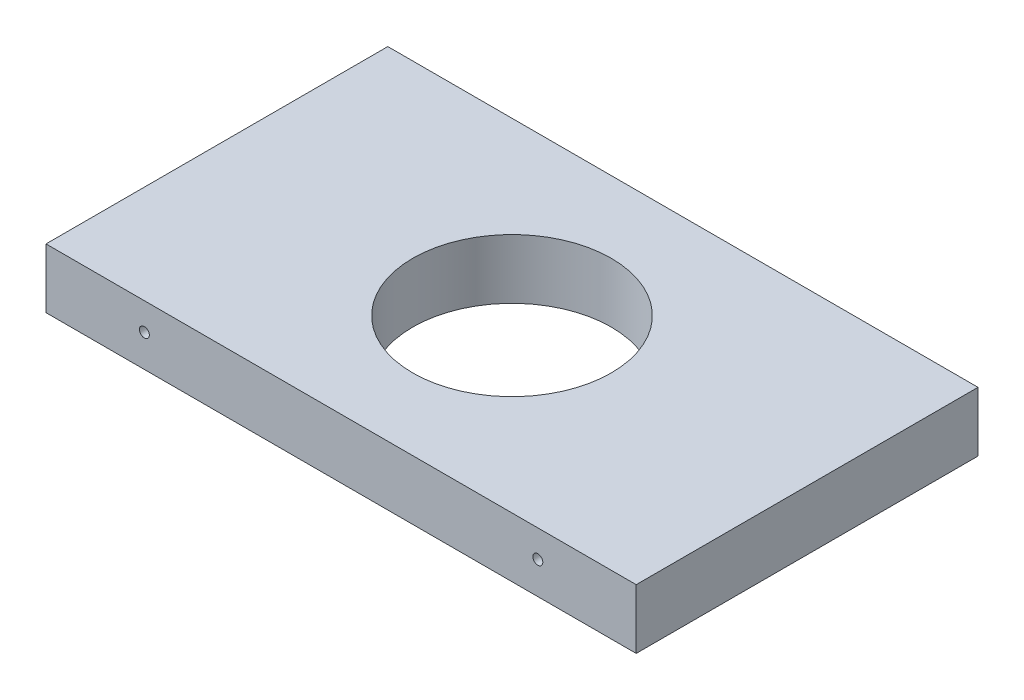
ISO-10303-21;
HEADER;
FILE_DESCRIPTION(('STEP AP214'),'2;1');
FILE_NAME('part.step','',(''),(''),'','','');
FILE_SCHEMA(('AUTOMOTIVE_DESIGN { 1 0 10303 214 1 1 1 1 }'));
ENDSEC;
DATA;
#1=APPLICATION_CONTEXT('core data for automotive mechanical design processes');
#2=APPLICATION_PROTOCOL_DEFINITION('international standard','automotive_design',2000,#1);
#3=PRODUCT_CONTEXT('',#1,'mechanical');
#4=PRODUCT('Part','Part','',(#3));
#5=PRODUCT_RELATED_PRODUCT_CATEGORY('part','',(#4));
#6=PRODUCT_DEFINITION_FORMATION('','',#4);
#7=PRODUCT_DEFINITION_CONTEXT('part definition',#1,'design');
#8=PRODUCT_DEFINITION('design','',#6,#7);
#9=PRODUCT_DEFINITION_SHAPE('','',#8);
#10=(LENGTH_UNIT() NAMED_UNIT(*) SI_UNIT(.MILLI.,.METRE.));
#11=(NAMED_UNIT(*) PLANE_ANGLE_UNIT() SI_UNIT($,.RADIAN.));
#12=(NAMED_UNIT(*) SI_UNIT($,.STERADIAN.) SOLID_ANGLE_UNIT());
#13=UNCERTAINTY_MEASURE_WITH_UNIT(LENGTH_MEASURE(1.E-05),#10,'distance_accuracy_value','');
#14=(GEOMETRIC_REPRESENTATION_CONTEXT(3) GLOBAL_UNCERTAINTY_ASSIGNED_CONTEXT((#13)) GLOBAL_UNIT_ASSIGNED_CONTEXT((#10,
#11,#12)) REPRESENTATION_CONTEXT('',''));
#15=CARTESIAN_POINT('',(0.,0.,0.));
#16=DIRECTION('',(0.,0.,1.));
#17=DIRECTION('',(1.,0.,0.));
#18=AXIS2_PLACEMENT_3D('',#15,#16,#17);
#19=CARTESIAN_POINT('',(-322.254465963192,-301.846060846021,298.984021790825));
#20=DIRECTION('',(1.,0.,0.));
#21=DIRECTION('',(0.,0.,-1.00000000000003));
#22=AXIS2_PLACEMENT_3D('',#19,#20,#21);
#23=PLANE('',#22);
#24=DIRECTION('',(0.,-1.00000000000005,0.));
#25=VECTOR('',#24,1.);
#26=CARTESIAN_POINT('',(-322.254465963194,-301.846060846017,109.300000000013));
#27=LINE('',#26,#25);
#28=CARTESIAN_POINT('',(-322.254465963193,-282.796060846016,109.300000000013));
#29=VERTEX_POINT('',#28);
#30=CARTESIAN_POINT('',(-322.254465963193,-301.846060846017,109.300000000013));
#31=VERTEX_POINT('',#30);
#32=EDGE_CURVE('E141',#29,#31,#27,.T.);
#33=ORIENTED_EDGE('',*,*,#32,.F.);
#34=DIRECTION('',(0.,0.,-1.00000000000003));
#35=VECTOR('',#34,1.);
#36=CARTESIAN_POINT('',(-322.254465963191,-282.79606084602,298.984021790825));
#37=LINE('',#36,#35);
#38=CARTESIAN_POINT('',(-322.254465963193,-282.796060846013,7.21644966006352E-12));
#39=VERTEX_POINT('',#38);
#40=EDGE_CURVE('E57',#29,#39,#37,.T.);
#41=ORIENTED_EDGE('',*,*,#40,.T.);
#42=DIRECTION('',(0.,-1.00000000000005,0.));
#43=VECTOR('',#42,1.);
#44=CARTESIAN_POINT('',(-322.254465963193,-301.846060846014,8.43769498715119E-12));
#45=LINE('',#44,#43);
#46=CARTESIAN_POINT('',(-322.254465963193,-301.846060846014,8.43769498715119E-12));
#47=VERTEX_POINT('',#46);
#48=EDGE_CURVE('E137',#39,#47,#45,.T.);
#49=ORIENTED_EDGE('',*,*,#48,.T.);
#50=DIRECTION('',(0.,0.,-1.00000000000003));
#51=VECTOR('',#50,1.);
#52=CARTESIAN_POINT('',(-322.254465963192,-301.846060846021,298.984021790825));
#53=LINE('',#52,#51);
#54=EDGE_CURVE('E80',#31,#47,#53,.T.);
#55=ORIENTED_EDGE('',*,*,#54,.F.);
#56=EDGE_LOOP('',(#33,#41,#49,#55));
#57=FACE_BOUND('',#56,.T.);
#58=ADVANCED_FACE('F40',(#57),#23,.F.);
#59=CARTESIAN_POINT('',(-322.254465963192,-301.846060846021,298.984021790825));
#60=DIRECTION('',(0.,1.00000000000005,0.));
#61=DIRECTION('',(0.,0.,1.00000000000003));
#62=AXIS2_PLACEMENT_3D('',#59,#60,#61);
#63=PLANE('',#62);
#64=CARTESIAN_POINT('',(-227.891965966195,-301.846060846016,54.6500000000101));
#65=DIRECTION('',(0.,1.00000000000005,0.));
#66=DIRECTION('',(0.,0.,1.00000000000003));
#67=AXIS2_PLACEMENT_3D('',#64,#65,#66);
#68=CIRCLE('',#67,31.75);
#69=CARTESIAN_POINT('',(-227.891965966195,-301.846060846016,86.4000000000111));
#70=VERTEX_POINT('',#69);
#71=EDGE_CURVE('E109',#70,#70,#68,.T.);
#72=ORIENTED_EDGE('',*,*,#71,.T.);
#73=EDGE_LOOP('',(#72));
#74=FACE_BOUND('',#73,.T.);
#75=DIRECTION('',(1.,0.,0.));
#76=VECTOR('',#75,1.);
#77=CARTESIAN_POINT('',(-322.254465963193,-301.846060846017,109.300000000014));
#78=LINE('',#77,#76);
#79=CARTESIAN_POINT('',(-133.529465969192,-301.846060846017,109.300000000012));
#80=VERTEX_POINT('',#79);
#81=EDGE_CURVE('E49',#31,#80,#78,.T.);
#82=ORIENTED_EDGE('',*,*,#81,.F.);
#83=ORIENTED_EDGE('',*,*,#54,.T.);
#84=DIRECTION('',(1.,0.,0.));
#85=VECTOR('',#84,1.);
#86=CARTESIAN_POINT('',(-322.254465963193,-301.846060846014,8.43769498715119E-12));
#87=LINE('',#86,#85);
#88=CARTESIAN_POINT('',(-133.529465969193,-301.846060846013,7.105427357601E-12));
#89=VERTEX_POINT('',#88);
#90=EDGE_CURVE('E135',#47,#89,#87,.T.);
#91=ORIENTED_EDGE('',*,*,#90,.T.);
#92=DIRECTION('',(0.,0.,-1.00000000000003));
#93=VECTOR('',#92,1.);
#94=CARTESIAN_POINT('',(-133.529465969192,-301.846060846021,298.984021790824));
#95=LINE('',#94,#93);
#96=EDGE_CURVE('E134',#80,#89,#95,.T.);
#97=ORIENTED_EDGE('',*,*,#96,.F.);
#98=EDGE_LOOP('',(#82,#83,#91,#97));
#99=FACE_BOUND('',#98,.T.);
#100=ADVANCED_FACE('F174',(#74,#99),#63,.F.);
#101=CARTESIAN_POINT('',(-133.529465969192,-301.846060846021,298.984021790824));
#102=DIRECTION('',(-1.,0.,0.));
#103=DIRECTION('',(0.,0.,1.00000000000003));
#104=AXIS2_PLACEMENT_3D('',#101,#102,#103);
#105=PLANE('',#104);
#106=DIRECTION('',(0.,1.00000000000005,0.));
#107=VECTOR('',#106,1.);
#108=CARTESIAN_POINT('',(-133.529465969192,-301.846060846017,109.300000000011));
#109=LINE('',#108,#107);
#110=CARTESIAN_POINT('',(-133.529465969192,-282.796060846015,109.300000000011));
#111=VERTEX_POINT('',#110);
#112=EDGE_CURVE('E11',#80,#111,#109,.T.);
#113=ORIENTED_EDGE('',*,*,#112,.F.);
#114=ORIENTED_EDGE('',*,*,#96,.T.);
#115=DIRECTION('',(0.,1.00000000000005,0.));
#116=VECTOR('',#115,1.);
#117=CARTESIAN_POINT('',(-133.529465969193,-301.846060846013,7.105427357601E-12));
#118=LINE('',#117,#116);
#119=CARTESIAN_POINT('',(-133.529465969193,-282.796060846011,6.43929354282591E-12));
#120=VERTEX_POINT('',#119);
#121=EDGE_CURVE('E132',#89,#120,#118,.T.);
#122=ORIENTED_EDGE('',*,*,#121,.T.);
#123=DIRECTION('',(0.,0.,-1.00000000000003));
#124=VECTOR('',#123,1.);
#125=CARTESIAN_POINT('',(-133.529465969192,-282.796060846019,298.984021790825));
#126=LINE('',#125,#124);
#127=EDGE_CURVE('E63',#111,#120,#126,.T.);
#128=ORIENTED_EDGE('',*,*,#127,.F.);
#129=EDGE_LOOP('',(#113,#114,#122,#128));
#130=FACE_BOUND('',#129,.T.);
#131=ADVANCED_FACE('F165',(#130),#105,.F.);
#132=CARTESIAN_POINT('',(-322.254465963191,-282.79606084602,298.984021790825));
#133=DIRECTION('',(0.,-1.00000000000005,0.));
#134=DIRECTION('',(0.,0.,-1.00000000000003));
#135=AXIS2_PLACEMENT_3D('',#132,#133,#134);
#136=PLANE('',#135);
#137=CARTESIAN_POINT('',(-227.891965966193,-282.796060846014,54.6500000000094));
#138=DIRECTION('',(0.,1.00000000000005,0.));
#139=DIRECTION('',(0.,0.,1.00000000000003));
#140=AXIS2_PLACEMENT_3D('',#137,#138,#139);
#141=CIRCLE('',#140,31.75);
#142=CARTESIAN_POINT('',(-227.891965966193,-282.796060846015,86.4000000000104));
#143=VERTEX_POINT('',#142);
#144=EDGE_CURVE('E114',#143,#143,#141,.T.);
#145=ORIENTED_EDGE('',*,*,#144,.F.);
#146=EDGE_LOOP('',(#145));
#147=FACE_BOUND('',#146,.T.);
#148=DIRECTION('',(-1.,0.,0.));
#149=VECTOR('',#148,1.);
#150=CARTESIAN_POINT('',(-322.254465963193,-282.796060846016,109.300000000012));
#151=LINE('',#150,#149);
#152=EDGE_CURVE('E131',#111,#29,#151,.T.);
#153=ORIENTED_EDGE('',*,*,#152,.F.);
#154=ORIENTED_EDGE('',*,*,#127,.T.);
#155=DIRECTION('',(-1.,0.,0.));
#156=VECTOR('',#155,1.);
#157=CARTESIAN_POINT('',(-322.254465963193,-282.796060846013,7.21644966006352E-12));
#158=LINE('',#157,#156);
#159=EDGE_CURVE('E129',#120,#39,#158,.T.);
#160=ORIENTED_EDGE('',*,*,#159,.T.);
#161=ORIENTED_EDGE('',*,*,#40,.F.);
#162=EDGE_LOOP('',(#153,#154,#160,#161));
#163=FACE_BOUND('',#162,.T.);
#164=ADVANCED_FACE('F163',(#147,#163),#136,.F.);
#165=CARTESIAN_POINT('',(0.,0.,0.));
#166=DIRECTION('',(0.,0.,-1.00000000000003));
#167=DIRECTION('',(-1.,0.,0.));
#168=AXIS2_PLACEMENT_3D('',#165,#166,#167);
#169=PLANE('',#168);
#170=CARTESIAN_POINT('',(-290.800299297527,-291.54606084602,6.99440505513849E-12));
#171=DIRECTION('',(0.,0.,-1.00000000000003));
#172=DIRECTION('',(-1.,0.,0.));
#173=AXIS2_PLACEMENT_3D('',#170,#171,#172);
#174=CIRCLE('',#173,1.58750000000002);
#175=CARTESIAN_POINT('',(-292.387799297527,-291.54606084602,6.99466942699622E-12));
#176=VERTEX_POINT('',#175);
#177=EDGE_CURVE('E124',#176,#176,#174,.T.);
#178=ORIENTED_EDGE('',*,*,#177,.F.);
#179=EDGE_LOOP('',(#178));
#180=FACE_BOUND('',#179,.T.);
#181=CARTESIAN_POINT('',(-164.983632634859,-291.54606084602,6.60582699651968E-12));
#182=DIRECTION('',(0.,0.,-1.00000000000003));
#183=DIRECTION('',(-1.,0.,0.));
#184=AXIS2_PLACEMENT_3D('',#181,#182,#183);
#185=CIRCLE('',#184,1.58749999999999);
#186=CARTESIAN_POINT('',(-166.571132634859,-291.54606084602,6.60609136837742E-12));
#187=VERTEX_POINT('',#186);
#188=EDGE_CURVE('E128',#187,#187,#185,.T.);
#189=ORIENTED_EDGE('',*,*,#188,.F.);
#190=EDGE_LOOP('',(#189));
#191=FACE_BOUND('',#190,.T.);
#192=ORIENTED_EDGE('',*,*,#48,.F.);
#193=ORIENTED_EDGE('',*,*,#159,.F.);
#194=ORIENTED_EDGE('',*,*,#121,.F.);
#195=ORIENTED_EDGE('',*,*,#90,.F.);
#196=EDGE_LOOP('',(#192,#193,#194,#195));
#197=FACE_BOUND('',#196,.T.);
#198=ADVANCED_FACE('F161',(#180,#191,#197),#169,.T.);
#199=CARTESIAN_POINT('',(3.88578058618805E-13,-204.862851166391,109.300000000009));
#200=DIRECTION('',(0.,0.,1.00000000000003));
#201=DIRECTION('',(-1.,0.,0.));
#202=AXIS2_PLACEMENT_3D('',#199,#200,#201);
#203=PLANE('',#202);
#204=CARTESIAN_POINT('',(-164.983632634859,-291.546060846022,109.300000000012));
#205=DIRECTION('',(0.,0.,1.00000000000003));
#206=DIRECTION('',(1.,0.,0.));
#207=AXIS2_PLACEMENT_3D('',#204,#205,#206);
#208=CIRCLE('',#207,1.58749999999999);
#209=CARTESIAN_POINT('',(-163.396132634859,-291.546060846022,109.300000000012));
#210=VERTEX_POINT('',#209);
#211=EDGE_CURVE('E44',#210,#210,#208,.T.);
#212=ORIENTED_EDGE('',*,*,#211,.F.);
#213=EDGE_LOOP('',(#212));
#214=FACE_BOUND('',#213,.T.);
#215=CARTESIAN_POINT('',(-290.800299297527,-291.546060846023,109.300000000013));
#216=DIRECTION('',(0.,0.,1.00000000000003));
#217=DIRECTION('',(1.,0.,0.));
#218=AXIS2_PLACEMENT_3D('',#215,#216,#217);
#219=CIRCLE('',#218,1.58750000000002);
#220=CARTESIAN_POINT('',(-289.212799297527,-291.546060846023,109.300000000013));
#221=VERTEX_POINT('',#220);
#222=EDGE_CURVE('E120',#221,#221,#219,.T.);
#223=ORIENTED_EDGE('',*,*,#222,.F.);
#224=EDGE_LOOP('',(#223));
#225=FACE_BOUND('',#224,.T.);
#226=ORIENTED_EDGE('',*,*,#152,.T.);
#227=ORIENTED_EDGE('',*,*,#32,.T.);
#228=ORIENTED_EDGE('',*,*,#81,.T.);
#229=ORIENTED_EDGE('',*,*,#112,.T.);
#230=EDGE_LOOP('',(#226,#227,#228,#229));
#231=FACE_BOUND('',#230,.T.);
#232=ADVANCED_FACE('F42',(#214,#225,#231),#203,.T.);
#233=CARTESIAN_POINT('',(-164.98363263486,-291.546060846019,19.0500000000081));
#234=DIRECTION('',(0.,0.,-1.00000000000003));
#235=DIRECTION('',(0.,1.00000000000005,0.));
#236=AXIS2_PLACEMENT_3D('',#233,#234,#235);
#237=CONICAL_SURFACE('',#236,1.58749999999999,1.02974425867665);
#238=CARTESIAN_POINT('',(-164.98363263486,-291.546060846021,20.0038662327143));
#239=VERTEX_POINT('',#238);
#240=VERTEX_LOOP('',#239);
#241=FACE_BOUND('',#240,.T.);
#242=CARTESIAN_POINT('',(-164.98363263486,-291.546060846019,19.0500000000081));
#243=DIRECTION('',(0.,0.,-1.00000000000003));
#244=DIRECTION('',(0.,1.00000000000005,0.));
#245=AXIS2_PLACEMENT_3D('',#242,#243,#244);
#246=CIRCLE('',#245,1.58749999999999);
#247=CARTESIAN_POINT('',(-164.98363263486,-289.958560846019,19.0500000000081));
#248=VERTEX_POINT('',#247);
#249=EDGE_CURVE('E125',#248,#248,#246,.T.);
#250=ORIENTED_EDGE('',*,*,#249,.T.);
#251=EDGE_LOOP('',(#250));
#252=FACE_BOUND('',#251,.T.);
#253=ADVANCED_FACE('F160',(#241,#252),#237,.F.);
#254=CARTESIAN_POINT('',(-164.98363263486,-291.54606084602,-12.6999999999938));
#255=DIRECTION('',(0.,0.,-1.00000000000003));
#256=DIRECTION('',(0.,1.00000000000005,0.));
#257=AXIS2_PLACEMENT_3D('',#254,#255,#256);
#258=CYLINDRICAL_SURFACE('',#257,1.58749999999999);
#259=ORIENTED_EDGE('',*,*,#188,.T.);
#260=EDGE_LOOP('',(#259));
#261=FACE_BOUND('',#260,.T.);
#262=ORIENTED_EDGE('',*,*,#249,.F.);
#263=EDGE_LOOP('',(#262));
#264=FACE_BOUND('',#263,.T.);
#265=ADVANCED_FACE('F217',(#261,#264),#258,.F.);
#266=CARTESIAN_POINT('',(-290.800299297527,-291.54606084602,19.0500000000083));
#267=DIRECTION('',(0.,0.,-1.00000000000003));
#268=DIRECTION('',(0.,1.00000000000005,0.));
#269=AXIS2_PLACEMENT_3D('',#266,#267,#268);
#270=CONICAL_SURFACE('',#269,1.58750000000002,1.02974425867666);
#271=CARTESIAN_POINT('',(-290.800299297527,-291.546060846021,20.0038662327148));
#272=VERTEX_POINT('',#271);
#273=VERTEX_LOOP('',#272);
#274=FACE_BOUND('',#273,.T.);
#275=CARTESIAN_POINT('',(-290.800299297527,-291.54606084602,19.0500000000083));
#276=DIRECTION('',(0.,0.,-1.00000000000003));
#277=DIRECTION('',(0.,1.00000000000005,0.));
#278=AXIS2_PLACEMENT_3D('',#275,#276,#277);
#279=CIRCLE('',#278,1.58750000000002);
#280=CARTESIAN_POINT('',(-290.800299297527,-289.95856084602,19.0500000000083));
#281=VERTEX_POINT('',#280);
#282=EDGE_CURVE('E121',#281,#281,#279,.T.);
#283=ORIENTED_EDGE('',*,*,#282,.T.);
#284=EDGE_LOOP('',(#283));
#285=FACE_BOUND('',#284,.T.);
#286=ADVANCED_FACE('F213',(#274,#285),#270,.F.);
#287=CARTESIAN_POINT('',(-290.800299297528,-291.546060846021,-12.6999999999932));
#288=DIRECTION('',(0.,0.,-1.00000000000003));
#289=DIRECTION('',(0.,1.00000000000005,0.));
#290=AXIS2_PLACEMENT_3D('',#287,#288,#289);
#291=CYLINDRICAL_SURFACE('',#290,1.58750000000002);
#292=ORIENTED_EDGE('',*,*,#177,.T.);
#293=EDGE_LOOP('',(#292));
#294=FACE_BOUND('',#293,.T.);
#295=ORIENTED_EDGE('',*,*,#282,.F.);
#296=EDGE_LOOP('',(#295));
#297=FACE_BOUND('',#296,.T.);
#298=ADVANCED_FACE('F209',(#294,#297),#291,.F.);
#299=CARTESIAN_POINT('',(-290.800299297527,-291.546060846022,90.2500000000112));
#300=DIRECTION('',(0.,0.,1.00000000000003));
#301=DIRECTION('',(1.,0.,0.));
#302=AXIS2_PLACEMENT_3D('',#299,#300,#301);
#303=CONICAL_SURFACE('',#302,1.58750000000002,1.02974425867667);
#304=CARTESIAN_POINT('',(-290.800299297527,-291.546060846023,89.2961337673049));
#305=VERTEX_POINT('',#304);
#306=VERTEX_LOOP('',#305);
#307=FACE_BOUND('',#306,.T.);
#308=CARTESIAN_POINT('',(-290.800299297527,-291.546060846022,90.2500000000112));
#309=DIRECTION('',(0.,0.,1.00000000000003));
#310=DIRECTION('',(1.,0.,0.));
#311=AXIS2_PLACEMENT_3D('',#308,#309,#310);
#312=CIRCLE('',#311,1.58750000000002);
#313=CARTESIAN_POINT('',(-289.212799297527,-291.546060846022,90.2500000000112));
#314=VERTEX_POINT('',#313);
#315=EDGE_CURVE('E112',#314,#314,#312,.T.);
#316=ORIENTED_EDGE('',*,*,#315,.T.);
#317=EDGE_LOOP('',(#316));
#318=FACE_BOUND('',#317,.T.);
#319=ADVANCED_FACE('F206',(#307,#318),#303,.F.);
#320=CARTESIAN_POINT('',(-290.800299297526,-291.546060846023,122.000000000012));
#321=DIRECTION('',(0.,0.,1.00000000000003));
#322=DIRECTION('',(1.,0.,0.));
#323=AXIS2_PLACEMENT_3D('',#320,#321,#322);
#324=CYLINDRICAL_SURFACE('',#323,1.58750000000002);
#325=ORIENTED_EDGE('',*,*,#222,.T.);
#326=EDGE_LOOP('',(#325));
#327=FACE_BOUND('',#326,.T.);
#328=ORIENTED_EDGE('',*,*,#315,.F.);
#329=EDGE_LOOP('',(#328));
#330=FACE_BOUND('',#329,.T.);
#331=ADVANCED_FACE('F103',(#327,#330),#324,.F.);
#332=CARTESIAN_POINT('',(-164.983632634859,-291.546060846022,90.2500000000108));
#333=DIRECTION('',(0.,0.,1.00000000000003));
#334=DIRECTION('',(1.,0.,0.));
#335=AXIS2_PLACEMENT_3D('',#332,#333,#334);
#336=CONICAL_SURFACE('',#335,1.58749999999999,1.02974425867666);
#337=CARTESIAN_POINT('',(-164.983632634859,-291.546060846022,89.2961337673044));
#338=VERTEX_POINT('',#337);
#339=VERTEX_LOOP('',#338);
#340=FACE_BOUND('',#339,.T.);
#341=CARTESIAN_POINT('',(-164.983632634859,-291.546060846022,90.2500000000108));
#342=DIRECTION('',(0.,0.,1.00000000000003));
#343=DIRECTION('',(1.,0.,0.));
#344=AXIS2_PLACEMENT_3D('',#341,#342,#343);
#345=CIRCLE('',#344,1.58749999999999);
#346=CARTESIAN_POINT('',(-163.396132634859,-291.546060846022,90.2500000000108));
#347=VERTEX_POINT('',#346);
#348=EDGE_CURVE('E107',#347,#347,#345,.T.);
#349=ORIENTED_EDGE('',*,*,#348,.T.);
#350=EDGE_LOOP('',(#349));
#351=FACE_BOUND('',#350,.T.);
#352=ADVANCED_FACE('F99',(#340,#351),#336,.F.);
#353=CARTESIAN_POINT('',(-164.983632634859,-291.546060846023,122.000000000011));
#354=DIRECTION('',(0.,0.,1.00000000000003));
#355=DIRECTION('',(1.,0.,0.));
#356=AXIS2_PLACEMENT_3D('',#353,#354,#355);
#357=CYLINDRICAL_SURFACE('',#356,1.58749999999999);
#358=ORIENTED_EDGE('',*,*,#211,.T.);
#359=EDGE_LOOP('',(#358));
#360=FACE_BOUND('',#359,.T.);
#361=ORIENTED_EDGE('',*,*,#348,.F.);
#362=EDGE_LOOP('',(#361));
#363=FACE_BOUND('',#362,.T.);
#364=ADVANCED_FACE('F102',(#360,#363),#357,.F.);
#365=CARTESIAN_POINT('',(-227.891965966193,-282.796060846014,54.6500000000094));
#366=DIRECTION('',(0.,1.00000000000005,0.));
#367=DIRECTION('',(0.,0.,1.00000000000003));
#368=AXIS2_PLACEMENT_3D('',#365,#366,#367);
#369=CYLINDRICAL_SURFACE('',#368,31.75);
#370=ORIENTED_EDGE('',*,*,#71,.F.);
#371=EDGE_LOOP('',(#370));
#372=FACE_BOUND('',#371,.T.);
#373=ORIENTED_EDGE('',*,*,#144,.T.);
#374=EDGE_LOOP('',(#373));
#375=FACE_BOUND('',#374,.T.);
#376=ADVANCED_FACE('F193',(#372,#375),#369,.F.);
#377=CLOSED_SHELL('',(#58,#100,#131,#164,#198,#232,#253,#265,#286,#298,#319,#331,#352,#364,#376));
#378=MANIFOLD_SOLID_BREP('B2',#377);
#379=ADVANCED_BREP_SHAPE_REPRESENTATION('',(#18,#378),#14);
#380=SHAPE_DEFINITION_REPRESENTATION(#9,#379);
ENDSEC;
END-ISO-10303-21;
